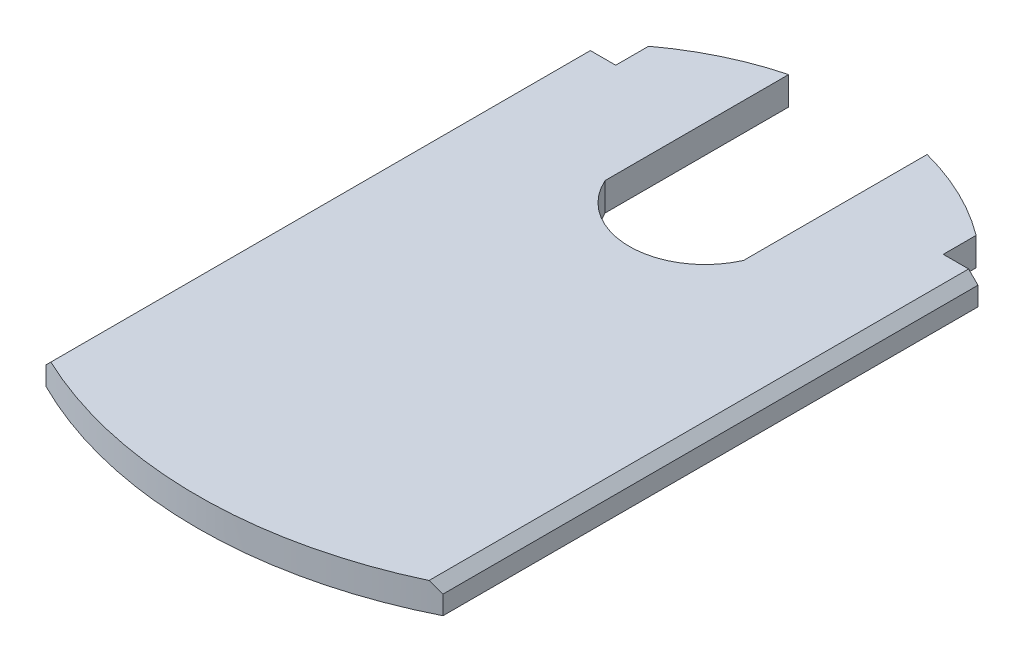
ISO-10303-21;
HEADER;
FILE_DESCRIPTION(('STEP AP214'),'2;1');
FILE_NAME('part.step','',(''),(''),'','','');
FILE_SCHEMA(('AUTOMOTIVE_DESIGN { 1 0 10303 214 1 1 1 1 }'));
ENDSEC;
DATA;
#1=APPLICATION_CONTEXT('core data for automotive mechanical design processes');
#2=APPLICATION_PROTOCOL_DEFINITION('international standard','automotive_design',2000,#1);
#3=PRODUCT_CONTEXT('',#1,'mechanical');
#4=PRODUCT('Part','Part','',(#3));
#5=PRODUCT_RELATED_PRODUCT_CATEGORY('part','',(#4));
#6=PRODUCT_DEFINITION_FORMATION('','',#4);
#7=PRODUCT_DEFINITION_CONTEXT('part definition',#1,'design');
#8=PRODUCT_DEFINITION('design','',#6,#7);
#9=PRODUCT_DEFINITION_SHAPE('','',#8);
#10=(LENGTH_UNIT() NAMED_UNIT(*) SI_UNIT(.MILLI.,.METRE.));
#11=(NAMED_UNIT(*) PLANE_ANGLE_UNIT() SI_UNIT($,.RADIAN.));
#12=(NAMED_UNIT(*) SI_UNIT($,.STERADIAN.) SOLID_ANGLE_UNIT());
#13=UNCERTAINTY_MEASURE_WITH_UNIT(LENGTH_MEASURE(1.E-05),#10,'distance_accuracy_value','');
#14=(GEOMETRIC_REPRESENTATION_CONTEXT(3) GLOBAL_UNCERTAINTY_ASSIGNED_CONTEXT((#13)) GLOBAL_UNIT_ASSIGNED_CONTEXT((#10,
#11,#12)) REPRESENTATION_CONTEXT('',''));
#15=CARTESIAN_POINT('',(0.,0.,0.));
#16=DIRECTION('',(0.,0.,1.));
#17=DIRECTION('',(1.,0.,0.));
#18=AXIS2_PLACEMENT_3D('',#15,#16,#17);
#19=CARTESIAN_POINT('',(0.,3.,-8.64978448275858));
#20=DIRECTION('',(0.,-1.,0.));
#21=DIRECTION('',(0.,0.,-1.));
#22=AXIS2_PLACEMENT_3D('',#19,#20,#21);
#23=CYLINDRICAL_SURFACE('',#22,29.1502155172414);
#24=DIRECTION('',(0.,-1.,0.));
#25=VECTOR('',#24,1.);
#26=CARTESIAN_POINT('',(7.37499999999999,3.,-36.8516361897232));
#27=LINE('',#26,#25);
#28=CARTESIAN_POINT('',(7.37499999999999,3.,-36.8516361897232));
#29=VERTEX_POINT('',#28);
#30=CARTESIAN_POINT('',(7.37499999999999,0.,-36.8516361897232));
#31=VERTEX_POINT('',#30);
#32=EDGE_CURVE('E172',#29,#31,#27,.T.);
#33=ORIENTED_EDGE('',*,*,#32,.F.);
#34=CARTESIAN_POINT('',(0.,3.,-8.64978448275858));
#35=DIRECTION('',(0.,1.,0.));
#36=DIRECTION('',(0.,0.,1.));
#37=AXIS2_PLACEMENT_3D('',#34,#35,#36);
#38=CIRCLE('',#37,29.1502155172414);
#39=CARTESIAN_POINT('',(17.45,3.,-32.));
#40=VERTEX_POINT('',#39);
#41=EDGE_CURVE('E184',#29,#40,#38,.F.);
#42=ORIENTED_EDGE('',*,*,#41,.T.);
#43=DIRECTION('',(0.,-1.,0.));
#44=VECTOR('',#43,1.);
#45=CARTESIAN_POINT('',(17.45,3.,-32.));
#46=LINE('',#45,#44);
#47=CARTESIAN_POINT('',(17.45,0.,-32.));
#48=VERTEX_POINT('',#47);
#49=EDGE_CURVE('E217',#40,#48,#46,.T.);
#50=ORIENTED_EDGE('',*,*,#49,.T.);
#51=CARTESIAN_POINT('',(0.,0.,-8.64978448275858));
#52=DIRECTION('',(0.,1.,0.));
#53=DIRECTION('',(0.,0.,1.));
#54=AXIS2_PLACEMENT_3D('',#51,#52,#53);
#55=CIRCLE('',#54,29.1502155172414);
#56=EDGE_CURVE('E204',#31,#48,#55,.F.);
#57=ORIENTED_EDGE('',*,*,#56,.F.);
#58=EDGE_LOOP('',(#33,#42,#50,#57));
#59=FACE_BOUND('',#58,.T.);
#60=ADVANCED_FACE('F39',(#59),#23,.T.);
#61=CARTESIAN_POINT('',(-21.15,3.,0.));
#62=DIRECTION('',(1.,0.,0.));
#63=DIRECTION('',(0.,0.,-1.));
#64=AXIS2_PLACEMENT_3D('',#61,#62,#63);
#65=PLANE('',#64);
#66=DIRECTION('',(0.,-1.,0.));
#67=VECTOR('',#66,1.);
#68=CARTESIAN_POINT('',(-21.15,3.,28.5));
#69=LINE('',#68,#67);
#70=CARTESIAN_POINT('',(-21.15,1.99999999999999,28.5));
#71=VERTEX_POINT('',#70);
#72=CARTESIAN_POINT('',(-21.15,0.,28.5));
#73=VERTEX_POINT('',#72);
#74=EDGE_CURVE('E226',#71,#73,#69,.T.);
#75=ORIENTED_EDGE('',*,*,#74,.F.);
#76=DIRECTION('',(0.,0.,-1.));
#77=VECTOR('',#76,1.);
#78=CARTESIAN_POINT('',(-21.15,1.99999999999999,-28.5));
#79=LINE('',#78,#77);
#80=CARTESIAN_POINT('',(-21.15,1.99999999999999,-28.5));
#81=VERTEX_POINT('',#80);
#82=EDGE_CURVE('E48',#71,#81,#79,.T.);
#83=ORIENTED_EDGE('',*,*,#82,.T.);
#84=DIRECTION('',(0.,-1.,0.));
#85=VECTOR('',#84,1.);
#86=CARTESIAN_POINT('',(-21.15,3.,-28.5));
#87=LINE('',#86,#85);
#88=CARTESIAN_POINT('',(-21.15,0.,-28.5));
#89=VERTEX_POINT('',#88);
#90=EDGE_CURVE('E211',#81,#89,#87,.T.);
#91=ORIENTED_EDGE('',*,*,#90,.T.);
#92=DIRECTION('',(0.,0.,1.));
#93=VECTOR('',#92,1.);
#94=CARTESIAN_POINT('',(-21.15,0.,0.));
#95=LINE('',#94,#93);
#96=EDGE_CURVE('E174',#89,#73,#95,.T.);
#97=ORIENTED_EDGE('',*,*,#96,.T.);
#98=EDGE_LOOP('',(#75,#83,#91,#97));
#99=FACE_BOUND('',#98,.T.);
#100=ADVANCED_FACE('F264',(#99),#65,.F.);
#101=CARTESIAN_POINT('',(0.,3.,-13.73225));
#102=DIRECTION('',(0.,-1.,0.));
#103=DIRECTION('',(0.,0.,-1.));
#104=AXIS2_PLACEMENT_3D('',#101,#102,#103);
#105=CYLINDRICAL_SURFACE('',#104,47.23225);
#106=DIRECTION('',(0.,-1.,0.));
#107=VECTOR('',#106,1.);
#108=CARTESIAN_POINT('',(21.15,3.,28.5));
#109=LINE('',#108,#107);
#110=CARTESIAN_POINT('',(21.15,2.,28.5));
#111=VERTEX_POINT('',#110);
#112=CARTESIAN_POINT('',(21.15,0.,28.5));
#113=VERTEX_POINT('',#112);
#114=EDGE_CURVE('E224',#111,#113,#109,.T.);
#115=ORIENTED_EDGE('',*,*,#114,.F.);
#116=CARTESIAN_POINT('',(0.,23.1499999999999,-13.73225));
#117=DIRECTION('',(-0.707106781186545,-0.70710678118655,0.));
#118=DIRECTION('',(0.70710678118655,-0.707106781186545,0.));
#119=AXIS2_PLACEMENT_3D('',#116,#117,#118);
#120=ELLIPSE('',#119,66.7964885313963,47.23225);
#121=CARTESIAN_POINT('',(20.15,3.,28.9861645312358));
#122=VERTEX_POINT('',#121);
#123=EDGE_CURVE('E236',#111,#122,#120,.T.);
#124=ORIENTED_EDGE('',*,*,#123,.T.);
#125=CARTESIAN_POINT('',(0.,3.,-13.73225));
#126=DIRECTION('',(0.,1.,0.));
#127=DIRECTION('',(0.,0.,1.));
#128=AXIS2_PLACEMENT_3D('',#125,#126,#127);
#129=CIRCLE('',#128,47.23225);
#130=CARTESIAN_POINT('',(-20.15,3.,28.9861645312358));
#131=VERTEX_POINT('',#130);
#132=EDGE_CURVE('E175',#131,#122,#129,.T.);
#133=ORIENTED_EDGE('',*,*,#132,.F.);
#134=CARTESIAN_POINT('',(0.,23.1500000000001,-13.73225));
#135=DIRECTION('',(-0.70710678118655,0.707106781186545,0.));
#136=DIRECTION('',(-0.707106781186545,-0.70710678118655,0.));
#137=AXIS2_PLACEMENT_3D('',#134,#135,#136);
#138=ELLIPSE('',#137,66.7964885313968,47.23225);
#139=EDGE_CURVE('E234',#131,#71,#138,.F.);
#140=ORIENTED_EDGE('',*,*,#139,.T.);
#141=ORIENTED_EDGE('',*,*,#74,.T.);
#142=CARTESIAN_POINT('',(0.,0.,-13.73225));
#143=DIRECTION('',(0.,1.,0.));
#144=DIRECTION('',(0.,0.,1.));
#145=AXIS2_PLACEMENT_3D('',#142,#143,#144);
#146=CIRCLE('',#145,47.23225);
#147=EDGE_CURVE('E192',#73,#113,#146,.T.);
#148=ORIENTED_EDGE('',*,*,#147,.T.);
#149=EDGE_LOOP('',(#115,#124,#133,#140,#141,#148));
#150=FACE_BOUND('',#149,.T.);
#151=ADVANCED_FACE('F257',(#150),#105,.T.);
#152=CARTESIAN_POINT('',(21.15,3.,0.));
#153=DIRECTION('',(1.,0.,0.));
#154=DIRECTION('',(0.,0.,-1.));
#155=AXIS2_PLACEMENT_3D('',#152,#153,#154);
#156=PLANE('',#155);
#157=DIRECTION('',(0.,-1.,0.));
#158=VECTOR('',#157,1.);
#159=CARTESIAN_POINT('',(21.15,3.,-28.5));
#160=LINE('',#159,#158);
#161=CARTESIAN_POINT('',(21.15,2.,-28.5));
#162=VERTEX_POINT('',#161);
#163=CARTESIAN_POINT('',(21.15,0.,-28.5));
#164=VERTEX_POINT('',#163);
#165=EDGE_CURVE('E222',#162,#164,#160,.T.);
#166=ORIENTED_EDGE('',*,*,#165,.F.);
#167=DIRECTION('',(0.,0.,1.));
#168=VECTOR('',#167,1.);
#169=CARTESIAN_POINT('',(21.15,2.,0.));
#170=LINE('',#169,#168);
#171=EDGE_CURVE('E231',#162,#111,#170,.T.);
#172=ORIENTED_EDGE('',*,*,#171,.T.);
#173=ORIENTED_EDGE('',*,*,#114,.T.);
#174=DIRECTION('',(0.,0.,1.));
#175=VECTOR('',#174,1.);
#176=CARTESIAN_POINT('',(21.15,0.,0.));
#177=LINE('',#176,#175);
#178=EDGE_CURVE('E195',#164,#113,#177,.T.);
#179=ORIENTED_EDGE('',*,*,#178,.F.);
#180=EDGE_LOOP('',(#166,#172,#173,#179));
#181=FACE_BOUND('',#180,.T.);
#182=ADVANCED_FACE('F252',(#181),#156,.T.);
#183=CARTESIAN_POINT('',(0.,3.,-28.5));
#184=DIRECTION('',(0.,0.,-1.));
#185=DIRECTION('',(-1.,0.,0.));
#186=AXIS2_PLACEMENT_3D('',#183,#184,#185);
#187=PLANE('',#186);
#188=DIRECTION('',(1.,0.,0.));
#189=VECTOR('',#188,1.);
#190=CARTESIAN_POINT('',(0.,3.,-28.5));
#191=LINE('',#190,#189);
#192=CARTESIAN_POINT('',(17.45,3.,-28.5));
#193=VERTEX_POINT('',#192);
#194=CARTESIAN_POINT('',(20.15,3.,-28.5));
#195=VERTEX_POINT('',#194);
#196=EDGE_CURVE('E177',#193,#195,#191,.T.);
#197=ORIENTED_EDGE('',*,*,#196,.T.);
#198=DIRECTION('',(-0.70710678118655,0.707106781186545,0.));
#199=VECTOR('',#198,1.);
#200=CARTESIAN_POINT('',(10.0749999999999,13.075,-28.5));
#201=LINE('',#200,#199);
#202=EDGE_CURVE('E242',#195,#162,#201,.F.);
#203=ORIENTED_EDGE('',*,*,#202,.T.);
#204=ORIENTED_EDGE('',*,*,#165,.T.);
#205=DIRECTION('',(1.,0.,0.));
#206=VECTOR('',#205,1.);
#207=CARTESIAN_POINT('',(0.,0.,-28.5));
#208=LINE('',#207,#206);
#209=CARTESIAN_POINT('',(17.45,0.,-28.5));
#210=VERTEX_POINT('',#209);
#211=EDGE_CURVE('E198',#210,#164,#208,.T.);
#212=ORIENTED_EDGE('',*,*,#211,.F.);
#213=DIRECTION('',(0.,-1.,0.));
#214=VECTOR('',#213,1.);
#215=CARTESIAN_POINT('',(17.45,3.,-28.5));
#216=LINE('',#215,#214);
#217=EDGE_CURVE('E220',#193,#210,#216,.T.);
#218=ORIENTED_EDGE('',*,*,#217,.F.);
#219=EDGE_LOOP('',(#197,#203,#204,#212,#218));
#220=FACE_BOUND('',#219,.T.);
#221=ADVANCED_FACE('F246',(#220),#187,.T.);
#222=CARTESIAN_POINT('',(17.45,3.,0.));
#223=DIRECTION('',(1.,0.,0.));
#224=DIRECTION('',(0.,0.,-1.));
#225=AXIS2_PLACEMENT_3D('',#222,#223,#224);
#226=PLANE('',#225);
#227=DIRECTION('',(0.,0.,1.));
#228=VECTOR('',#227,1.);
#229=CARTESIAN_POINT('',(17.45,0.,0.));
#230=LINE('',#229,#228);
#231=EDGE_CURVE('E201',#48,#210,#230,.T.);
#232=ORIENTED_EDGE('',*,*,#231,.F.);
#233=ORIENTED_EDGE('',*,*,#49,.F.);
#234=DIRECTION('',(0.,0.,1.));
#235=VECTOR('',#234,1.);
#236=CARTESIAN_POINT('',(17.45,3.,0.));
#237=LINE('',#236,#235);
#238=EDGE_CURVE('E180',#40,#193,#237,.T.);
#239=ORIENTED_EDGE('',*,*,#238,.T.);
#240=ORIENTED_EDGE('',*,*,#217,.T.);
#241=EDGE_LOOP('',(#232,#233,#239,#240));
#242=FACE_BOUND('',#241,.T.);
#243=ADVANCED_FACE('F280',(#242),#226,.T.);
#244=DIRECTION('',(0.,-1.,0.));
#245=VECTOR('',#244,1.);
#246=CARTESIAN_POINT('',(-7.37499999999999,3.,-36.8516361897232));
#247=LINE('',#246,#245);
#248=CARTESIAN_POINT('',(-7.37499999999999,0.,-36.8516361897232));
#249=VERTEX_POINT('',#248);
#250=CARTESIAN_POINT('',(-7.37499999999999,3.,-36.8516361897232));
#251=VERTEX_POINT('',#250);
#252=EDGE_CURVE('E147',#249,#251,#247,.F.);
#253=ORIENTED_EDGE('',*,*,#252,.F.);
#254=CARTESIAN_POINT('',(-17.45,0.,-32.));
#255=VERTEX_POINT('',#254);
#256=EDGE_CURVE('E205',#255,#249,#55,.F.);
#257=ORIENTED_EDGE('',*,*,#256,.F.);
#258=DIRECTION('',(0.,-1.,0.));
#259=VECTOR('',#258,1.);
#260=CARTESIAN_POINT('',(-17.45,3.,-32.));
#261=LINE('',#260,#259);
#262=CARTESIAN_POINT('',(-17.45,3.,-32.));
#263=VERTEX_POINT('',#262);
#264=EDGE_CURVE('E215',#263,#255,#261,.T.);
#265=ORIENTED_EDGE('',*,*,#264,.F.);
#266=EDGE_CURVE('E185',#263,#251,#38,.F.);
#267=ORIENTED_EDGE('',*,*,#266,.T.);
#268=EDGE_LOOP('',(#253,#257,#265,#267));
#269=FACE_BOUND('',#268,.T.);
#270=ADVANCED_FACE('F278',(#269),#23,.T.);
#271=CARTESIAN_POINT('',(-17.45,3.,0.));
#272=DIRECTION('',(-1.,0.,0.));
#273=DIRECTION('',(0.,0.,1.));
#274=AXIS2_PLACEMENT_3D('',#271,#272,#273);
#275=PLANE('',#274);
#276=DIRECTION('',(0.,0.,-1.));
#277=VECTOR('',#276,1.);
#278=CARTESIAN_POINT('',(-17.45,0.,0.));
#279=LINE('',#278,#277);
#280=CARTESIAN_POINT('',(-17.45,0.,-28.5));
#281=VERTEX_POINT('',#280);
#282=EDGE_CURVE('E208',#281,#255,#279,.T.);
#283=ORIENTED_EDGE('',*,*,#282,.F.);
#284=DIRECTION('',(0.,-1.,0.));
#285=VECTOR('',#284,1.);
#286=CARTESIAN_POINT('',(-17.45,3.,-28.5));
#287=LINE('',#286,#285);
#288=CARTESIAN_POINT('',(-17.45,3.,-28.5));
#289=VERTEX_POINT('',#288);
#290=EDGE_CURVE('E213',#289,#281,#287,.T.);
#291=ORIENTED_EDGE('',*,*,#290,.F.);
#292=DIRECTION('',(0.,0.,-1.));
#293=VECTOR('',#292,1.);
#294=CARTESIAN_POINT('',(-17.45,3.,0.));
#295=LINE('',#294,#293);
#296=EDGE_CURVE('E187',#289,#263,#295,.T.);
#297=ORIENTED_EDGE('',*,*,#296,.T.);
#298=ORIENTED_EDGE('',*,*,#264,.T.);
#299=EDGE_LOOP('',(#283,#291,#297,#298));
#300=FACE_BOUND('',#299,.T.);
#301=ADVANCED_FACE('F275',(#300),#275,.T.);
#302=ORIENTED_EDGE('',*,*,#90,.F.);
#303=DIRECTION('',(0.707106781186545,0.70710678118655,0.));
#304=VECTOR('',#303,1.);
#305=CARTESIAN_POINT('',(-10.0750000000001,13.075,-28.5));
#306=LINE('',#305,#304);
#307=CARTESIAN_POINT('',(-20.15,3.,-28.5));
#308=VERTEX_POINT('',#307);
#309=EDGE_CURVE('E11',#81,#308,#306,.T.);
#310=ORIENTED_EDGE('',*,*,#309,.T.);
#311=EDGE_CURVE('E181',#308,#289,#191,.T.);
#312=ORIENTED_EDGE('',*,*,#311,.T.);
#313=ORIENTED_EDGE('',*,*,#290,.T.);
#314=EDGE_CURVE('E178',#89,#281,#208,.T.);
#315=ORIENTED_EDGE('',*,*,#314,.F.);
#316=EDGE_LOOP('',(#302,#310,#312,#313,#315));
#317=FACE_BOUND('',#316,.T.);
#318=ADVANCED_FACE('F271',(#317),#187,.T.);
#319=CARTESIAN_POINT('',(0.,3.,0.));
#320=DIRECTION('',(0.,1.,0.));
#321=DIRECTION('',(0.,0.,1.));
#322=AXIS2_PLACEMENT_3D('',#319,#320,#321);
#323=PLANE('',#322);
#324=ORIENTED_EDGE('',*,*,#132,.T.);
#325=DIRECTION('',(0.,0.,-1.));
#326=VECTOR('',#325,1.);
#327=CARTESIAN_POINT('',(20.15,3.,0.));
#328=LINE('',#327,#326);
#329=EDGE_CURVE('E62',#122,#195,#328,.T.);
#330=ORIENTED_EDGE('',*,*,#329,.T.);
#331=ORIENTED_EDGE('',*,*,#196,.F.);
#332=ORIENTED_EDGE('',*,*,#238,.F.);
#333=ORIENTED_EDGE('',*,*,#41,.F.);
#334=DIRECTION('',(0.,0.,-1.));
#335=VECTOR('',#334,1.);
#336=CARTESIAN_POINT('',(7.375,3.,-17.3));
#337=LINE('',#336,#335);
#338=CARTESIAN_POINT('',(7.375,3.,-17.3));
#339=VERTEX_POINT('',#338);
#340=EDGE_CURVE('E152',#339,#29,#337,.T.);
#341=ORIENTED_EDGE('',*,*,#340,.F.);
#342=CARTESIAN_POINT('',(0.,3.,-20.5656901041667));
#343=DIRECTION('',(0.,1.,0.));
#344=DIRECTION('',(0.,0.,1.));
#345=AXIS2_PLACEMENT_3D('',#342,#343,#344);
#346=CIRCLE('',#345,8.06569010416666);
#347=CARTESIAN_POINT('',(-7.375,3.,-17.3));
#348=VERTEX_POINT('',#347);
#349=EDGE_CURVE('E151',#348,#339,#346,.T.);
#350=ORIENTED_EDGE('',*,*,#349,.F.);
#351=DIRECTION('',(0.,0.,1.));
#352=VECTOR('',#351,1.);
#353=CARTESIAN_POINT('',(-7.375,3.,-17.3));
#354=LINE('',#353,#352);
#355=EDGE_CURVE('E141',#251,#348,#354,.T.);
#356=ORIENTED_EDGE('',*,*,#355,.F.);
#357=ORIENTED_EDGE('',*,*,#266,.F.);
#358=ORIENTED_EDGE('',*,*,#296,.F.);
#359=ORIENTED_EDGE('',*,*,#311,.F.);
#360=DIRECTION('',(0.,0.,1.));
#361=VECTOR('',#360,1.);
#362=CARTESIAN_POINT('',(-20.15,3.,28.5));
#363=LINE('',#362,#361);
#364=EDGE_CURVE('E238',#308,#131,#363,.T.);
#365=ORIENTED_EDGE('',*,*,#364,.T.);
#366=EDGE_LOOP('',(#324,#330,#331,#332,#333,#341,#350,#356,#357,#358,#359,#365));
#367=FACE_BOUND('',#366,.T.);
#368=ADVANCED_FACE('F164',(#367),#323,.T.);
#369=CARTESIAN_POINT('',(0.,0.,0.));
#370=DIRECTION('',(0.,1.,0.));
#371=DIRECTION('',(0.,0.,1.));
#372=AXIS2_PLACEMENT_3D('',#369,#370,#371);
#373=PLANE('',#372);
#374=CARTESIAN_POINT('',(0.,0.,-20.5656901041667));
#375=DIRECTION('',(0.,1.,0.));
#376=DIRECTION('',(0.,0.,1.));
#377=AXIS2_PLACEMENT_3D('',#374,#375,#376);
#378=CIRCLE('',#377,8.06569010416666);
#379=CARTESIAN_POINT('',(7.375,0.,-17.3));
#380=VERTEX_POINT('',#379);
#381=CARTESIAN_POINT('',(-7.375,0.,-17.3));
#382=VERTEX_POINT('',#381);
#383=EDGE_CURVE('E160',#380,#382,#378,.F.);
#384=ORIENTED_EDGE('',*,*,#383,.F.);
#385=DIRECTION('',(0.,0.,-1.));
#386=VECTOR('',#385,1.);
#387=CARTESIAN_POINT('',(7.37500000000001,0.,0.));
#388=LINE('',#387,#386);
#389=EDGE_CURVE('E228',#380,#31,#388,.T.);
#390=ORIENTED_EDGE('',*,*,#389,.T.);
#391=ORIENTED_EDGE('',*,*,#56,.T.);
#392=ORIENTED_EDGE('',*,*,#231,.T.);
#393=ORIENTED_EDGE('',*,*,#211,.T.);
#394=ORIENTED_EDGE('',*,*,#178,.T.);
#395=ORIENTED_EDGE('',*,*,#147,.F.);
#396=ORIENTED_EDGE('',*,*,#96,.F.);
#397=ORIENTED_EDGE('',*,*,#314,.T.);
#398=ORIENTED_EDGE('',*,*,#282,.T.);
#399=ORIENTED_EDGE('',*,*,#256,.T.);
#400=DIRECTION('',(0.,0.,-1.));
#401=VECTOR('',#400,1.);
#402=CARTESIAN_POINT('',(-7.375,0.,-17.3));
#403=LINE('',#402,#401);
#404=EDGE_CURVE('E169',#382,#249,#403,.T.);
#405=ORIENTED_EDGE('',*,*,#404,.F.);
#406=EDGE_LOOP('',(#384,#390,#391,#392,#393,#394,#395,#396,#397,#398,#399,#405));
#407=FACE_BOUND('',#406,.T.);
#408=ADVANCED_FACE('F269',(#407),#373,.F.);
#409=CARTESIAN_POINT('',(7.375,-29.2857047038312,-17.3));
#410=DIRECTION('',(1.,0.,0.));
#411=DIRECTION('',(0.,0.,-1.));
#412=AXIS2_PLACEMENT_3D('',#409,#410,#411);
#413=PLANE('',#412);
#414=ORIENTED_EDGE('',*,*,#32,.T.);
#415=ORIENTED_EDGE('',*,*,#389,.F.);
#416=DIRECTION('',(0.,1.,0.));
#417=VECTOR('',#416,1.);
#418=CARTESIAN_POINT('',(7.375,-29.2857047038312,-17.3));
#419=LINE('',#418,#417);
#420=EDGE_CURVE('E162',#380,#339,#419,.T.);
#421=ORIENTED_EDGE('',*,*,#420,.T.);
#422=ORIENTED_EDGE('',*,*,#340,.T.);
#423=EDGE_LOOP('',(#414,#415,#421,#422));
#424=FACE_BOUND('',#423,.T.);
#425=ADVANCED_FACE('F301',(#424),#413,.F.);
#426=CARTESIAN_POINT('',(0.,-29.2857047038312,-20.5656901041667));
#427=DIRECTION('',(0.,1.,0.));
#428=DIRECTION('',(0.,0.,1.));
#429=AXIS2_PLACEMENT_3D('',#426,#427,#428);
#430=CYLINDRICAL_SURFACE('',#429,8.06569010416666);
#431=ORIENTED_EDGE('',*,*,#383,.T.);
#432=DIRECTION('',(0.,1.,0.));
#433=VECTOR('',#432,1.);
#434=CARTESIAN_POINT('',(-7.375,-29.2857047038312,-17.3));
#435=LINE('',#434,#433);
#436=EDGE_CURVE('E144',#382,#348,#435,.T.);
#437=ORIENTED_EDGE('',*,*,#436,.T.);
#438=ORIENTED_EDGE('',*,*,#349,.T.);
#439=ORIENTED_EDGE('',*,*,#420,.F.);
#440=EDGE_LOOP('',(#431,#437,#438,#439));
#441=FACE_BOUND('',#440,.T.);
#442=ADVANCED_FACE('F156',(#441),#430,.F.);
#443=CARTESIAN_POINT('',(-7.375,-29.2857047038312,-17.3));
#444=DIRECTION('',(-1.,0.,0.));
#445=DIRECTION('',(0.,0.,1.));
#446=AXIS2_PLACEMENT_3D('',#443,#444,#445);
#447=PLANE('',#446);
#448=ORIENTED_EDGE('',*,*,#252,.T.);
#449=ORIENTED_EDGE('',*,*,#355,.T.);
#450=ORIENTED_EDGE('',*,*,#436,.F.);
#451=ORIENTED_EDGE('',*,*,#404,.T.);
#452=EDGE_LOOP('',(#448,#449,#450,#451));
#453=FACE_BOUND('',#452,.T.);
#454=ADVANCED_FACE('F143',(#453),#447,.F.);
#455=CARTESIAN_POINT('',(21.15,2.,0.));
#456=DIRECTION('',(-0.707106781186545,-0.70710678118655,0.));
#457=DIRECTION('',(0.,0.,1.));
#458=AXIS2_PLACEMENT_3D('',#455,#456,#457);
#459=PLANE('',#458);
#460=ORIENTED_EDGE('',*,*,#202,.F.);
#461=ORIENTED_EDGE('',*,*,#329,.F.);
#462=ORIENTED_EDGE('',*,*,#123,.F.);
#463=ORIENTED_EDGE('',*,*,#171,.F.);
#464=EDGE_LOOP('',(#460,#461,#462,#463));
#465=FACE_BOUND('',#464,.T.);
#466=ADVANCED_FACE('F254',(#465),#459,.F.);
#467=CARTESIAN_POINT('',(-20.15,3.,0.));
#468=DIRECTION('',(-0.70710678118655,0.707106781186545,0.));
#469=DIRECTION('',(0.,0.,-1.));
#470=AXIS2_PLACEMENT_3D('',#467,#468,#469);
#471=PLANE('',#470);
#472=ORIENTED_EDGE('',*,*,#309,.F.);
#473=ORIENTED_EDGE('',*,*,#82,.F.);
#474=ORIENTED_EDGE('',*,*,#139,.F.);
#475=ORIENTED_EDGE('',*,*,#364,.F.);
#476=EDGE_LOOP('',(#472,#473,#474,#475));
#477=FACE_BOUND('',#476,.T.);
#478=ADVANCED_FACE('F42',(#477),#471,.T.);
#479=CLOSED_SHELL('',(#60,#100,#151,#182,#221,#243,#270,#301,#318,#368,#408,#425,#442,#454,#466,#478));
#480=MANIFOLD_SOLID_BREP('B2',#479);
#481=ADVANCED_BREP_SHAPE_REPRESENTATION('',(#18,#480),#14);
#482=SHAPE_DEFINITION_REPRESENTATION(#9,#481);
ENDSEC;
END-ISO-10303-21;
